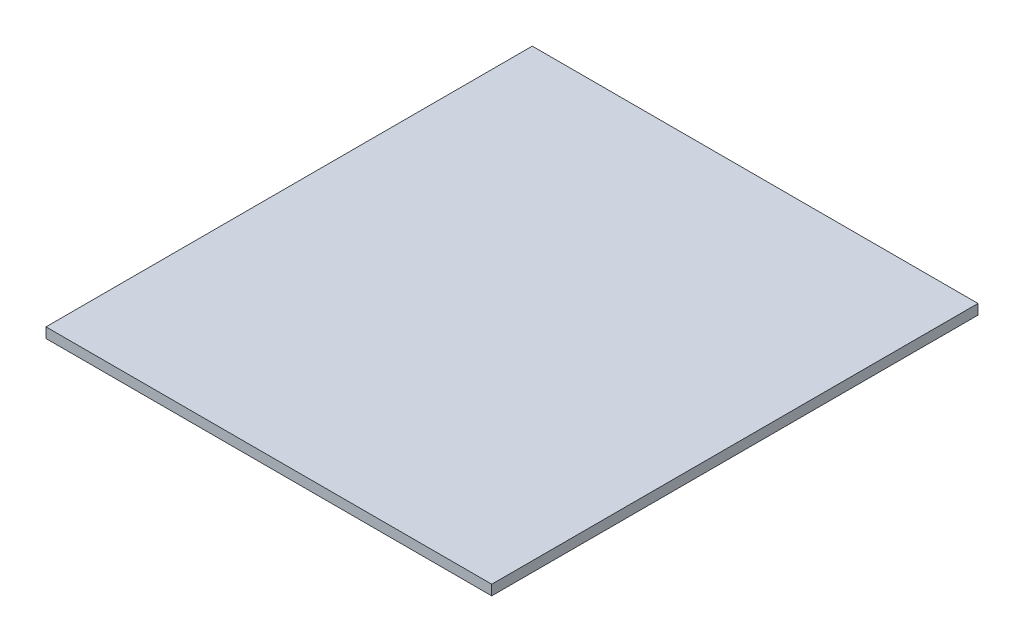
ISO-10303-21;
HEADER;
FILE_DESCRIPTION(('STEP AP214'),'2;1');
FILE_NAME('part.step','',(''),(''),'','','');
FILE_SCHEMA(('AUTOMOTIVE_DESIGN { 1 0 10303 214 1 1 1 1 }'));
ENDSEC;
DATA;
#1=APPLICATION_CONTEXT('core data for automotive mechanical design processes');
#2=APPLICATION_PROTOCOL_DEFINITION('international standard','automotive_design',2000,#1);
#3=PRODUCT_CONTEXT('',#1,'mechanical');
#4=PRODUCT('Part','Part','',(#3));
#5=PRODUCT_RELATED_PRODUCT_CATEGORY('part','',(#4));
#6=PRODUCT_DEFINITION_FORMATION('','',#4);
#7=PRODUCT_DEFINITION_CONTEXT('part definition',#1,'design');
#8=PRODUCT_DEFINITION('design','',#6,#7);
#9=PRODUCT_DEFINITION_SHAPE('','',#8);
#10=(LENGTH_UNIT() NAMED_UNIT(*) SI_UNIT(.MILLI.,.METRE.));
#11=(NAMED_UNIT(*) PLANE_ANGLE_UNIT() SI_UNIT($,.RADIAN.));
#12=(NAMED_UNIT(*) SI_UNIT($,.STERADIAN.) SOLID_ANGLE_UNIT());
#13=UNCERTAINTY_MEASURE_WITH_UNIT(LENGTH_MEASURE(1.E-05),#10,'distance_accuracy_value','');
#14=(GEOMETRIC_REPRESENTATION_CONTEXT(3) GLOBAL_UNCERTAINTY_ASSIGNED_CONTEXT((#13)) GLOBAL_UNIT_ASSIGNED_CONTEXT((#10,
#11,#12)) REPRESENTATION_CONTEXT('',''));
#15=CARTESIAN_POINT('',(0.,0.,0.));
#16=DIRECTION('',(0.,0.,1.));
#17=DIRECTION('',(1.,0.,0.));
#18=AXIS2_PLACEMENT_3D('',#15,#16,#17);
#19=CARTESIAN_POINT('',(-44.,2.,-48.));
#20=DIRECTION('',(0.,0.,-1.));
#21=DIRECTION('',(-1.,0.,0.));
#22=AXIS2_PLACEMENT_3D('',#19,#20,#21);
#23=PLANE('',#22);
#24=DIRECTION('',(1.,0.,0.));
#25=VECTOR('',#24,1.);
#26=CARTESIAN_POINT('',(-44.,0.,-48.));
#27=LINE('',#26,#25);
#28=CARTESIAN_POINT('',(-44.,0.,-48.));
#29=VERTEX_POINT('',#28);
#30=CARTESIAN_POINT('',(44.,0.,-48.));
#31=VERTEX_POINT('',#30);
#32=EDGE_CURVE('E103',#29,#31,#27,.T.);
#33=ORIENTED_EDGE('',*,*,#32,.F.);
#34=DIRECTION('',(0.,-1.,0.));
#35=VECTOR('',#34,1.);
#36=CARTESIAN_POINT('',(-44.,2.,-48.));
#37=LINE('',#36,#35);
#38=CARTESIAN_POINT('',(-44.,2.,-48.));
#39=VERTEX_POINT('',#38);
#40=EDGE_CURVE('E11',#39,#29,#37,.T.);
#41=ORIENTED_EDGE('',*,*,#40,.F.);
#42=DIRECTION('',(1.,0.,0.));
#43=VECTOR('',#42,1.);
#44=CARTESIAN_POINT('',(-44.,2.,-48.));
#45=LINE('',#44,#43);
#46=CARTESIAN_POINT('',(44.,2.,-48.));
#47=VERTEX_POINT('',#46);
#48=EDGE_CURVE('E98',#39,#47,#45,.T.);
#49=ORIENTED_EDGE('',*,*,#48,.T.);
#50=DIRECTION('',(0.,-1.,0.));
#51=VECTOR('',#50,1.);
#52=CARTESIAN_POINT('',(44.,2.,-48.));
#53=LINE('',#52,#51);
#54=EDGE_CURVE('E41',#47,#31,#53,.T.);
#55=ORIENTED_EDGE('',*,*,#54,.T.);
#56=EDGE_LOOP('',(#33,#41,#49,#55));
#57=FACE_BOUND('',#56,.T.);
#58=ADVANCED_FACE('F38',(#57),#23,.T.);
#59=CARTESIAN_POINT('',(-44.,2.,-48.));
#60=DIRECTION('',(1.,0.,0.));
#61=DIRECTION('',(0.,0.,-1.));
#62=AXIS2_PLACEMENT_3D('',#59,#60,#61);
#63=PLANE('',#62);
#64=DIRECTION('',(0.,0.,1.));
#65=VECTOR('',#64,1.);
#66=CARTESIAN_POINT('',(-44.,0.,-48.));
#67=LINE('',#66,#65);
#68=CARTESIAN_POINT('',(-44.,0.,48.));
#69=VERTEX_POINT('',#68);
#70=EDGE_CURVE('E71',#29,#69,#67,.T.);
#71=ORIENTED_EDGE('',*,*,#70,.T.);
#72=DIRECTION('',(0.,-1.,0.));
#73=VECTOR('',#72,1.);
#74=CARTESIAN_POINT('',(-44.,2.,48.));
#75=LINE('',#74,#73);
#76=CARTESIAN_POINT('',(-44.,2.,48.));
#77=VERTEX_POINT('',#76);
#78=EDGE_CURVE('E47',#77,#69,#75,.T.);
#79=ORIENTED_EDGE('',*,*,#78,.F.);
#80=DIRECTION('',(0.,0.,1.));
#81=VECTOR('',#80,1.);
#82=CARTESIAN_POINT('',(-44.,2.,-48.));
#83=LINE('',#82,#81);
#84=EDGE_CURVE('E88',#39,#77,#83,.T.);
#85=ORIENTED_EDGE('',*,*,#84,.F.);
#86=ORIENTED_EDGE('',*,*,#40,.T.);
#87=EDGE_LOOP('',(#71,#79,#85,#86));
#88=FACE_BOUND('',#87,.T.);
#89=ADVANCED_FACE('F113',(#88),#63,.F.);
#90=CARTESIAN_POINT('',(-44.,2.,48.));
#91=DIRECTION('',(0.,0.,-1.));
#92=DIRECTION('',(-1.,0.,0.));
#93=AXIS2_PLACEMENT_3D('',#90,#91,#92);
#94=PLANE('',#93);
#95=DIRECTION('',(1.,0.,0.));
#96=VECTOR('',#95,1.);
#97=CARTESIAN_POINT('',(-44.,0.,48.));
#98=LINE('',#97,#96);
#99=CARTESIAN_POINT('',(44.,0.,48.));
#100=VERTEX_POINT('',#99);
#101=EDGE_CURVE('E95',#69,#100,#98,.T.);
#102=ORIENTED_EDGE('',*,*,#101,.T.);
#103=DIRECTION('',(0.,-1.,0.));
#104=VECTOR('',#103,1.);
#105=CARTESIAN_POINT('',(44.,2.,48.));
#106=LINE('',#105,#104);
#107=CARTESIAN_POINT('',(44.,2.,48.));
#108=VERTEX_POINT('',#107);
#109=EDGE_CURVE('E92',#108,#100,#106,.T.);
#110=ORIENTED_EDGE('',*,*,#109,.F.);
#111=DIRECTION('',(1.,0.,0.));
#112=VECTOR('',#111,1.);
#113=CARTESIAN_POINT('',(-44.,2.,48.));
#114=LINE('',#113,#112);
#115=EDGE_CURVE('E83',#77,#108,#114,.T.);
#116=ORIENTED_EDGE('',*,*,#115,.F.);
#117=ORIENTED_EDGE('',*,*,#78,.T.);
#118=EDGE_LOOP('',(#102,#110,#116,#117));
#119=FACE_BOUND('',#118,.T.);
#120=ADVANCED_FACE('F93',(#119),#94,.F.);
#121=CARTESIAN_POINT('',(44.,2.,-48.));
#122=DIRECTION('',(1.,0.,0.));
#123=DIRECTION('',(0.,0.,-1.));
#124=AXIS2_PLACEMENT_3D('',#121,#122,#123);
#125=PLANE('',#124);
#126=DIRECTION('',(0.,0.,1.));
#127=VECTOR('',#126,1.);
#128=CARTESIAN_POINT('',(44.,0.,-48.));
#129=LINE('',#128,#127);
#130=EDGE_CURVE('E106',#31,#100,#129,.T.);
#131=ORIENTED_EDGE('',*,*,#130,.F.);
#132=ORIENTED_EDGE('',*,*,#54,.F.);
#133=DIRECTION('',(0.,0.,1.));
#134=VECTOR('',#133,1.);
#135=CARTESIAN_POINT('',(44.,2.,-48.));
#136=LINE('',#135,#134);
#137=EDGE_CURVE('E87',#47,#108,#136,.T.);
#138=ORIENTED_EDGE('',*,*,#137,.T.);
#139=ORIENTED_EDGE('',*,*,#109,.T.);
#140=EDGE_LOOP('',(#131,#132,#138,#139));
#141=FACE_BOUND('',#140,.T.);
#142=ADVANCED_FACE('F97',(#141),#125,.T.);
#143=CARTESIAN_POINT('',(0.,2.,0.));
#144=DIRECTION('',(0.,-1.,0.));
#145=DIRECTION('',(0.,0.,-1.));
#146=AXIS2_PLACEMENT_3D('',#143,#144,#145);
#147=PLANE('',#146);
#148=ORIENTED_EDGE('',*,*,#48,.F.);
#149=ORIENTED_EDGE('',*,*,#84,.T.);
#150=ORIENTED_EDGE('',*,*,#115,.T.);
#151=ORIENTED_EDGE('',*,*,#137,.F.);
#152=EDGE_LOOP('',(#148,#149,#150,#151));
#153=FACE_BOUND('',#152,.T.);
#154=ADVANCED_FACE('F86',(#153),#147,.F.);
#155=CARTESIAN_POINT('',(0.,0.,0.));
#156=DIRECTION('',(0.,-1.,0.));
#157=DIRECTION('',(0.,0.,-1.));
#158=AXIS2_PLACEMENT_3D('',#155,#156,#157);
#159=PLANE('',#158);
#160=ORIENTED_EDGE('',*,*,#32,.T.);
#161=ORIENTED_EDGE('',*,*,#130,.T.);
#162=ORIENTED_EDGE('',*,*,#101,.F.);
#163=ORIENTED_EDGE('',*,*,#70,.F.);
#164=EDGE_LOOP('',(#160,#161,#162,#163));
#165=FACE_BOUND('',#164,.T.);
#166=ADVANCED_FACE('F111',(#165),#159,.T.);
#167=CLOSED_SHELL('',(#58,#89,#120,#142,#154,#166));
#168=MANIFOLD_SOLID_BREP('B2',#167);
#169=ADVANCED_BREP_SHAPE_REPRESENTATION('',(#18,#168),#14);
#170=SHAPE_DEFINITION_REPRESENTATION(#9,#169);
ENDSEC;
END-ISO-10303-21;
